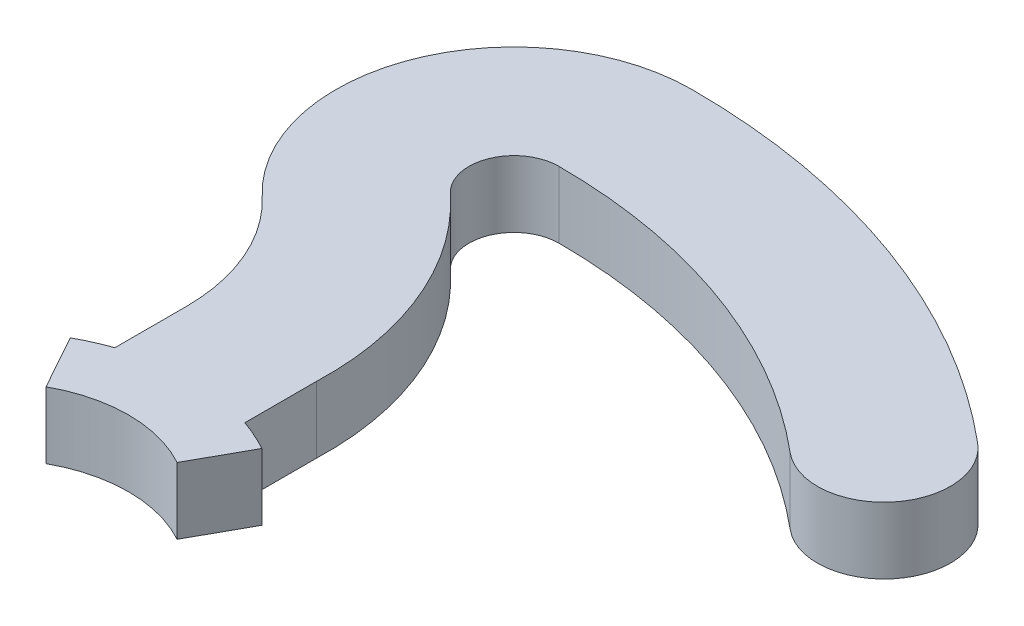
ISO-10303-21;
HEADER;
FILE_DESCRIPTION(('STEP AP214'),'2;1');
FILE_NAME('part.step','',(''),(''),'','','');
FILE_SCHEMA(('AUTOMOTIVE_DESIGN { 1 0 10303 214 1 1 1 1 }'));
ENDSEC;
DATA;
#1=APPLICATION_CONTEXT('core data for automotive mechanical design processes');
#2=APPLICATION_PROTOCOL_DEFINITION('international standard','automotive_design',2000,#1);
#3=PRODUCT_CONTEXT('',#1,'mechanical');
#4=PRODUCT('Part','Part','',(#3));
#5=PRODUCT_RELATED_PRODUCT_CATEGORY('part','',(#4));
#6=PRODUCT_DEFINITION_FORMATION('','',#4);
#7=PRODUCT_DEFINITION_CONTEXT('part definition',#1,'design');
#8=PRODUCT_DEFINITION('design','',#6,#7);
#9=PRODUCT_DEFINITION_SHAPE('','',#8);
#10=(LENGTH_UNIT() NAMED_UNIT(*) SI_UNIT(.MILLI.,.METRE.));
#11=(NAMED_UNIT(*) PLANE_ANGLE_UNIT() SI_UNIT($,.RADIAN.));
#12=(NAMED_UNIT(*) SI_UNIT($,.STERADIAN.) SOLID_ANGLE_UNIT());
#13=UNCERTAINTY_MEASURE_WITH_UNIT(LENGTH_MEASURE(1.E-05),#10,'distance_accuracy_value','');
#14=(GEOMETRIC_REPRESENTATION_CONTEXT(3) GLOBAL_UNCERTAINTY_ASSIGNED_CONTEXT((#13)) GLOBAL_UNIT_ASSIGNED_CONTEXT((#10,
#11,#12)) REPRESENTATION_CONTEXT('',''));
#15=CARTESIAN_POINT('',(0.,0.,0.));
#16=DIRECTION('',(0.,0.,1.));
#17=DIRECTION('',(1.,0.,0.));
#18=AXIS2_PLACEMENT_3D('',#15,#16,#17);
#19=CARTESIAN_POINT('',(6.2,3.175,0.));
#20=DIRECTION('',(-1.,0.,0.));
#21=DIRECTION('',(0.,0.,1.));
#22=AXIS2_PLACEMENT_3D('',#19,#20,#21);
#23=PLANE('',#22);
#24=DIRECTION('',(0.,0.,-1.));
#25=VECTOR('',#24,1.);
#26=CARTESIAN_POINT('',(6.2,-3.175,0.));
#27=LINE('',#26,#25);
#28=CARTESIAN_POINT('',(6.2,-3.175,-17.8011937801935));
#29=VERTEX_POINT('',#28);
#30=CARTESIAN_POINT('',(6.2,-3.175,-24.631686909345));
#31=VERTEX_POINT('',#30);
#32=EDGE_CURVE('E174',#29,#31,#27,.T.);
#33=ORIENTED_EDGE('',*,*,#32,.T.);
#34=DIRECTION('',(0.,-1.,0.));
#35=VECTOR('',#34,1.);
#36=CARTESIAN_POINT('',(6.2,3.175,-24.631686909345));
#37=LINE('',#36,#35);
#38=CARTESIAN_POINT('',(6.2,3.175,-24.631686909345));
#39=VERTEX_POINT('',#38);
#40=EDGE_CURVE('E11',#39,#31,#37,.T.);
#41=ORIENTED_EDGE('',*,*,#40,.F.);
#42=DIRECTION('',(0.,0.,-1.));
#43=VECTOR('',#42,1.);
#44=CARTESIAN_POINT('',(6.2,3.175,0.));
#45=LINE('',#44,#43);
#46=CARTESIAN_POINT('',(6.2,3.175,-17.8011937801935));
#47=VERTEX_POINT('',#46);
#48=EDGE_CURVE('E210',#47,#39,#45,.T.);
#49=ORIENTED_EDGE('',*,*,#48,.F.);
#50=DIRECTION('',(0.,-1.,0.));
#51=VECTOR('',#50,1.);
#52=CARTESIAN_POINT('',(6.2,3.175,-17.8011937801935));
#53=LINE('',#52,#51);
#54=EDGE_CURVE('E55',#47,#29,#53,.T.);
#55=ORIENTED_EDGE('',*,*,#54,.T.);
#56=EDGE_LOOP('',(#33,#41,#49,#55));
#57=FACE_BOUND('',#56,.T.);
#58=ADVANCED_FACE('F39',(#57),#23,.F.);
#59=CARTESIAN_POINT('',(-22.2918601541075,3.175,-25.6203194208465));
#60=DIRECTION('',(0.,-1.,0.));
#61=DIRECTION('',(0.,0.,-1.));
#62=AXIS2_PLACEMENT_3D('',#59,#60,#61);
#63=CYLINDRICAL_SURFACE('',#62,28.5090071606153);
#64=CARTESIAN_POINT('',(-22.2918601541075,-3.175,-25.6203194208465));
#65=DIRECTION('',(0.,1.,0.));
#66=DIRECTION('',(0.,0.,1.));
#67=AXIS2_PLACEMENT_3D('',#64,#65,#66);
#68=CIRCLE('',#67,28.5090071606153);
#69=CARTESIAN_POINT('',(-2.94847643107434,-3.175,-46.5630268730245));
#70=VERTEX_POINT('',#69);
#71=EDGE_CURVE('E176',#31,#70,#68,.T.);
#72=ORIENTED_EDGE('',*,*,#71,.T.);
#73=DIRECTION('',(0.,-1.,0.));
#74=VECTOR('',#73,1.);
#75=CARTESIAN_POINT('',(-2.94847643107434,3.175,-46.5630268730245));
#76=LINE('',#75,#74);
#77=CARTESIAN_POINT('',(-2.94847643107434,3.175,-46.5630268730245));
#78=VERTEX_POINT('',#77);
#79=EDGE_CURVE('E47',#78,#70,#76,.T.);
#80=ORIENTED_EDGE('',*,*,#79,.F.);
#81=CARTESIAN_POINT('',(-22.2918601541075,3.175,-25.6203194208465));
#82=DIRECTION('',(0.,1.,0.));
#83=DIRECTION('',(0.,0.,1.));
#84=AXIS2_PLACEMENT_3D('',#81,#82,#83);
#85=CIRCLE('',#84,28.5090071606153);
#86=EDGE_CURVE('E112',#39,#78,#85,.T.);
#87=ORIENTED_EDGE('',*,*,#86,.F.);
#88=ORIENTED_EDGE('',*,*,#40,.T.);
#89=EDGE_LOOP('',(#72,#80,#87,#88));
#90=FACE_BOUND('',#89,.T.);
#91=ADVANCED_FACE('F237',(#90),#63,.T.);
#92=CARTESIAN_POINT('',(0.,3.175,-49.6825627630093));
#93=DIRECTION('',(0.,-1.,0.));
#94=DIRECTION('',(0.,0.,-1.));
#95=AXIS2_PLACEMENT_3D('',#92,#93,#94);
#96=CYLINDRICAL_SURFACE('',#95,4.29243723699069);
#97=CARTESIAN_POINT('',(0.,-3.175,-49.6825627630093));
#98=DIRECTION('',(0.,1.,0.));
#99=DIRECTION('',(0.,0.,1.));
#100=AXIS2_PLACEMENT_3D('',#97,#98,#99);
#101=CIRCLE('',#100,4.29243723699069);
#102=CARTESIAN_POINT('',(0.,-3.175,-53.975));
#103=VERTEX_POINT('',#102);
#104=EDGE_CURVE('E179',#103,#70,#101,.T.);
#105=ORIENTED_EDGE('',*,*,#104,.F.);
#106=DIRECTION('',(0.,-1.,0.));
#107=VECTOR('',#106,1.);
#108=CARTESIAN_POINT('',(0.,3.175,-53.975));
#109=LINE('',#108,#107);
#110=CARTESIAN_POINT('',(0.,3.175,-53.975));
#111=VERTEX_POINT('',#110);
#112=EDGE_CURVE('E230',#111,#103,#109,.T.);
#113=ORIENTED_EDGE('',*,*,#112,.F.);
#114=CARTESIAN_POINT('',(0.,3.175,-49.6825627630093));
#115=DIRECTION('',(0.,1.,0.));
#116=DIRECTION('',(0.,0.,1.));
#117=AXIS2_PLACEMENT_3D('',#114,#115,#116);
#118=CIRCLE('',#117,4.29243723699069);
#119=EDGE_CURVE('E236',#111,#78,#118,.T.);
#120=ORIENTED_EDGE('',*,*,#119,.T.);
#121=ORIENTED_EDGE('',*,*,#79,.T.);
#122=EDGE_LOOP('',(#105,#113,#120,#121));
#123=FACE_BOUND('',#122,.T.);
#124=ADVANCED_FACE('F234',(#123),#96,.F.);
#125=CARTESIAN_POINT('',(0.,3.175,0.));
#126=DIRECTION('',(0.,-1.,0.));
#127=DIRECTION('',(0.,0.,-1.));
#128=AXIS2_PLACEMENT_3D('',#125,#126,#127);
#129=CYLINDRICAL_SURFACE('',#128,53.975);
#130=CARTESIAN_POINT('',(0.,-3.175,0.));
#131=DIRECTION('',(0.,1.,0.));
#132=DIRECTION('',(0.,0.,1.));
#133=AXIS2_PLACEMENT_3D('',#130,#131,#132);
#134=CIRCLE('',#133,53.975);
#135=CARTESIAN_POINT('',(34.6944612328307,-3.175,-41.347248817347));
#136=VERTEX_POINT('',#135);
#137=EDGE_CURVE('E182',#136,#103,#134,.T.);
#138=ORIENTED_EDGE('',*,*,#137,.F.);
#139=DIRECTION('',(0.,-1.,0.));
#140=VECTOR('',#139,1.);
#141=CARTESIAN_POINT('',(34.6944612328307,3.175,-41.347248817347));
#142=LINE('',#141,#140);
#143=CARTESIAN_POINT('',(34.6944612328307,3.175,-41.347248817347));
#144=VERTEX_POINT('',#143);
#145=EDGE_CURVE('E228',#144,#136,#142,.T.);
#146=ORIENTED_EDGE('',*,*,#145,.F.);
#147=CARTESIAN_POINT('',(0.,3.175,0.));
#148=DIRECTION('',(0.,1.,0.));
#149=DIRECTION('',(0.,0.,1.));
#150=AXIS2_PLACEMENT_3D('',#147,#148,#149);
#151=CIRCLE('',#150,53.975);
#152=EDGE_CURVE('E249',#144,#111,#151,.T.);
#153=ORIENTED_EDGE('',*,*,#152,.T.);
#154=ORIENTED_EDGE('',*,*,#112,.T.);
#155=EDGE_LOOP('',(#138,#146,#153,#154));
#156=FACE_BOUND('',#155,.T.);
#157=ADVANCED_FACE('F245',(#156),#129,.F.);
#158=CARTESIAN_POINT('',(38.7761625543402,3.175,-46.2116310311526));
#159=DIRECTION('',(0.,-1.,0.));
#160=DIRECTION('',(0.,0.,-1.));
#161=AXIS2_PLACEMENT_3D('',#158,#159,#160);
#162=CYLINDRICAL_SURFACE('',#161,6.34999999999999);
#163=CARTESIAN_POINT('',(38.7761625543402,-3.175,-46.2116310311526));
#164=DIRECTION('',(0.,1.,0.));
#165=DIRECTION('',(0.,0.,1.));
#166=AXIS2_PLACEMENT_3D('',#163,#164,#165);
#167=CIRCLE('',#166,6.34999999999999);
#168=CARTESIAN_POINT('',(42.8578638758497,-3.175,-51.0760132449581));
#169=VERTEX_POINT('',#168);
#170=EDGE_CURVE('E185',#136,#169,#167,.T.);
#171=ORIENTED_EDGE('',*,*,#170,.T.);
#172=DIRECTION('',(0.,-1.,0.));
#173=VECTOR('',#172,1.);
#174=CARTESIAN_POINT('',(42.8578638758497,3.175,-51.0760132449581));
#175=LINE('',#174,#173);
#176=CARTESIAN_POINT('',(42.8578638758497,3.175,-51.0760132449581));
#177=VERTEX_POINT('',#176);
#178=EDGE_CURVE('E225',#177,#169,#175,.T.);
#179=ORIENTED_EDGE('',*,*,#178,.F.);
#180=CARTESIAN_POINT('',(38.7761625543402,3.175,-46.2116310311526));
#181=DIRECTION('',(0.,1.,0.));
#182=DIRECTION('',(0.,0.,1.));
#183=AXIS2_PLACEMENT_3D('',#180,#181,#182);
#184=CIRCLE('',#183,6.34999999999999);
#185=EDGE_CURVE('E251',#144,#177,#184,.T.);
#186=ORIENTED_EDGE('',*,*,#185,.F.);
#187=ORIENTED_EDGE('',*,*,#145,.T.);
#188=EDGE_LOOP('',(#171,#179,#186,#187));
#189=FACE_BOUND('',#188,.T.);
#190=ADVANCED_FACE('F297',(#189),#162,.T.);
#191=CARTESIAN_POINT('',(0.,3.175,0.));
#192=DIRECTION('',(0.,-1.,0.));
#193=DIRECTION('',(0.,0.,-1.));
#194=AXIS2_PLACEMENT_3D('',#191,#192,#193);
#195=CYLINDRICAL_SURFACE('',#194,66.675);
#196=CARTESIAN_POINT('',(0.,-3.175,0.));
#197=DIRECTION('',(0.,1.,0.));
#198=DIRECTION('',(0.,0.,1.));
#199=AXIS2_PLACEMENT_3D('',#196,#197,#198);
#200=CIRCLE('',#199,66.675);
#201=CARTESIAN_POINT('',(0.,-3.175,-66.675));
#202=VERTEX_POINT('',#201);
#203=EDGE_CURVE('E187',#169,#202,#200,.T.);
#204=ORIENTED_EDGE('',*,*,#203,.T.);
#205=DIRECTION('',(0.,-1.,0.));
#206=VECTOR('',#205,1.);
#207=CARTESIAN_POINT('',(0.,3.175,-66.675));
#208=LINE('',#207,#206);
#209=CARTESIAN_POINT('',(0.,3.175,-66.675));
#210=VERTEX_POINT('',#209);
#211=EDGE_CURVE('E222',#210,#202,#208,.T.);
#212=ORIENTED_EDGE('',*,*,#211,.F.);
#213=CARTESIAN_POINT('',(0.,3.175,0.));
#214=DIRECTION('',(0.,1.,0.));
#215=DIRECTION('',(0.,0.,1.));
#216=AXIS2_PLACEMENT_3D('',#213,#214,#215);
#217=CIRCLE('',#216,66.675);
#218=EDGE_CURVE('E257',#177,#210,#217,.T.);
#219=ORIENTED_EDGE('',*,*,#218,.F.);
#220=ORIENTED_EDGE('',*,*,#178,.T.);
#221=EDGE_LOOP('',(#204,#212,#219,#220));
#222=FACE_BOUND('',#221,.T.);
#223=ADVANCED_FACE('F300',(#222),#195,.T.);
#224=CARTESIAN_POINT('',(0.,3.175,-49.6825627630093));
#225=DIRECTION('',(0.,-1.,0.));
#226=DIRECTION('',(0.,0.,-1.));
#227=AXIS2_PLACEMENT_3D('',#224,#225,#226);
#228=CYLINDRICAL_SURFACE('',#227,16.9924372369907);
#229=CARTESIAN_POINT('',(0.,-3.175,-49.6825627630093));
#230=DIRECTION('',(0.,1.,0.));
#231=DIRECTION('',(0.,0.,1.));
#232=AXIS2_PLACEMENT_3D('',#229,#230,#231);
#233=CIRCLE('',#232,16.9924372369907);
#234=CARTESIAN_POINT('',(-11.6721102566201,-3.175,-37.333280783462));
#235=VERTEX_POINT('',#234);
#236=EDGE_CURVE('E189',#202,#235,#233,.T.);
#237=ORIENTED_EDGE('',*,*,#236,.T.);
#238=DIRECTION('',(0.,-1.,0.));
#239=VECTOR('',#238,1.);
#240=CARTESIAN_POINT('',(-11.6721102566201,3.175,-37.333280783462));
#241=LINE('',#240,#239);
#242=CARTESIAN_POINT('',(-11.6721102566201,3.175,-37.333280783462));
#243=VERTEX_POINT('',#242);
#244=EDGE_CURVE('E220',#243,#235,#241,.T.);
#245=ORIENTED_EDGE('',*,*,#244,.F.);
#246=CARTESIAN_POINT('',(0.,3.175,-49.6825627630093));
#247=DIRECTION('',(0.,1.,0.));
#248=DIRECTION('',(0.,0.,1.));
#249=AXIS2_PLACEMENT_3D('',#246,#247,#248);
#250=CIRCLE('',#249,16.9924372369907);
#251=EDGE_CURVE('E259',#210,#243,#250,.T.);
#252=ORIENTED_EDGE('',*,*,#251,.F.);
#253=ORIENTED_EDGE('',*,*,#211,.T.);
#254=EDGE_LOOP('',(#237,#245,#252,#253));
#255=FACE_BOUND('',#254,.T.);
#256=ADVANCED_FACE('F304',(#255),#228,.T.);
#257=CARTESIAN_POINT('',(-23.6772134180055,3.175,-24.631686909345));
#258=DIRECTION('',(0.,-1.,0.));
#259=DIRECTION('',(0.,0.,-1.));
#260=AXIS2_PLACEMENT_3D('',#257,#258,#259);
#261=CYLINDRICAL_SURFACE('',#260,17.4772134180055);
#262=CARTESIAN_POINT('',(-23.6772134180055,-3.175,-24.631686909345));
#263=DIRECTION('',(0.,1.,0.));
#264=DIRECTION('',(0.,0.,1.));
#265=AXIS2_PLACEMENT_3D('',#262,#263,#264);
#266=CIRCLE('',#265,17.4772134180055);
#267=CARTESIAN_POINT('',(-6.2,-3.175,-24.631686909345));
#268=VERTEX_POINT('',#267);
#269=EDGE_CURVE('E192',#268,#235,#266,.T.);
#270=ORIENTED_EDGE('',*,*,#269,.F.);
#271=DIRECTION('',(0.,-1.,0.));
#272=VECTOR('',#271,1.);
#273=CARTESIAN_POINT('',(-6.2,3.175,-24.631686909345));
#274=LINE('',#273,#272);
#275=CARTESIAN_POINT('',(-6.2,3.175,-24.631686909345));
#276=VERTEX_POINT('',#275);
#277=EDGE_CURVE('E218',#276,#268,#274,.T.);
#278=ORIENTED_EDGE('',*,*,#277,.F.);
#279=CARTESIAN_POINT('',(-23.6772134180055,3.175,-24.631686909345));
#280=DIRECTION('',(0.,1.,0.));
#281=DIRECTION('',(0.,0.,1.));
#282=AXIS2_PLACEMENT_3D('',#279,#280,#281);
#283=CIRCLE('',#282,17.4772134180055);
#284=EDGE_CURVE('E261',#276,#243,#283,.T.);
#285=ORIENTED_EDGE('',*,*,#284,.T.);
#286=ORIENTED_EDGE('',*,*,#244,.T.);
#287=EDGE_LOOP('',(#270,#278,#285,#286));
#288=FACE_BOUND('',#287,.T.);
#289=ADVANCED_FACE('F308',(#288),#261,.F.);
#290=CARTESIAN_POINT('',(-6.20000000000001,3.175,0.));
#291=DIRECTION('',(-1.,0.,0.));
#292=DIRECTION('',(0.,0.,1.));
#293=AXIS2_PLACEMENT_3D('',#290,#291,#292);
#294=PLANE('',#293);
#295=DIRECTION('',(0.,0.,-1.));
#296=VECTOR('',#295,1.);
#297=CARTESIAN_POINT('',(-6.20000000000001,-3.175,0.));
#298=LINE('',#297,#296);
#299=CARTESIAN_POINT('',(-6.2,-3.175,-17.8011937801935));
#300=VERTEX_POINT('',#299);
#301=EDGE_CURVE('E195',#300,#268,#298,.T.);
#302=ORIENTED_EDGE('',*,*,#301,.F.);
#303=DIRECTION('',(0.,-1.,0.));
#304=VECTOR('',#303,1.);
#305=CARTESIAN_POINT('',(-6.2,3.175,-17.8011937801935));
#306=LINE('',#305,#304);
#307=CARTESIAN_POINT('',(-6.2,3.175,-17.8011937801935));
#308=VERTEX_POINT('',#307);
#309=EDGE_CURVE('E216',#308,#300,#306,.T.);
#310=ORIENTED_EDGE('',*,*,#309,.F.);
#311=DIRECTION('',(0.,0.,-1.));
#312=VECTOR('',#311,1.);
#313=CARTESIAN_POINT('',(-6.20000000000001,3.175,0.));
#314=LINE('',#313,#312);
#315=EDGE_CURVE('E264',#308,#276,#314,.T.);
#316=ORIENTED_EDGE('',*,*,#315,.T.);
#317=ORIENTED_EDGE('',*,*,#277,.T.);
#318=EDGE_LOOP('',(#302,#310,#316,#317));
#319=FACE_BOUND('',#318,.T.);
#320=ADVANCED_FACE('F312',(#319),#294,.T.);
#321=CARTESIAN_POINT('',(0.,3.175,0.));
#322=DIRECTION('',(0.,-1.,0.));
#323=DIRECTION('',(0.,0.,-1.));
#324=AXIS2_PLACEMENT_3D('',#321,#322,#323);
#325=CYLINDRICAL_SURFACE('',#324,18.85);
#326=CARTESIAN_POINT('',(0.,-3.175,0.));
#327=DIRECTION('',(0.,1.,0.));
#328=DIRECTION('',(0.,0.,1.));
#329=AXIS2_PLACEMENT_3D('',#326,#327,#328);
#330=CIRCLE('',#329,18.85);
#331=CARTESIAN_POINT('',(-9.1386613416436,-3.175,-16.4865814795775));
#332=VERTEX_POINT('',#331);
#333=EDGE_CURVE('E198',#332,#300,#330,.F.);
#334=ORIENTED_EDGE('',*,*,#333,.F.);
#335=DIRECTION('',(0.,-1.,0.));
#336=VECTOR('',#335,1.);
#337=CARTESIAN_POINT('',(-9.1386613416436,3.175,-16.4865814795775));
#338=LINE('',#337,#336);
#339=CARTESIAN_POINT('',(-9.1386613416436,3.175,-16.4865814795775));
#340=VERTEX_POINT('',#339);
#341=EDGE_CURVE('E214',#340,#332,#338,.T.);
#342=ORIENTED_EDGE('',*,*,#341,.F.);
#343=CARTESIAN_POINT('',(0.,3.175,0.));
#344=DIRECTION('',(0.,1.,0.));
#345=DIRECTION('',(0.,0.,1.));
#346=AXIS2_PLACEMENT_3D('',#343,#344,#345);
#347=CIRCLE('',#346,18.85);
#348=EDGE_CURVE('E169',#340,#308,#347,.F.);
#349=ORIENTED_EDGE('',*,*,#348,.T.);
#350=ORIENTED_EDGE('',*,*,#309,.T.);
#351=EDGE_LOOP('',(#334,#342,#349,#350));
#352=FACE_BOUND('',#351,.T.);
#353=ADVANCED_FACE('F269',(#352),#325,.T.);
#354=CARTESIAN_POINT('',(0.,3.175,0.));
#355=DIRECTION('',(-0.874619707139391,0.,0.484809620246345));
#356=DIRECTION('',(0.484809620246345,0.,0.874619707139391));
#357=AXIS2_PLACEMENT_3D('',#354,#355,#356);
#358=PLANE('',#357);
#359=DIRECTION('',(-0.484809620246345,0.,-0.874619707139391));
#360=VECTOR('',#359,1.);
#361=CARTESIAN_POINT('',(0.,-3.175,0.));
#362=LINE('',#361,#360);
#363=CARTESIAN_POINT('',(-6.25404410117785,-3.175,-11.2825942220982));
#364=VERTEX_POINT('',#363);
#365=EDGE_CURVE('E201',#364,#332,#362,.T.);
#366=ORIENTED_EDGE('',*,*,#365,.F.);
#367=DIRECTION('',(0.,-1.,0.));
#368=VECTOR('',#367,1.);
#369=CARTESIAN_POINT('',(-6.25404410117785,3.175,-11.2825942220982));
#370=LINE('',#369,#368);
#371=CARTESIAN_POINT('',(-6.25404410117785,3.175,-11.2825942220982));
#372=VERTEX_POINT('',#371);
#373=EDGE_CURVE('E155',#372,#364,#370,.T.);
#374=ORIENTED_EDGE('',*,*,#373,.F.);
#375=DIRECTION('',(-0.484809620246345,0.,-0.874619707139391));
#376=VECTOR('',#375,1.);
#377=CARTESIAN_POINT('',(0.,3.175,0.));
#378=LINE('',#377,#376);
#379=EDGE_CURVE('E167',#372,#340,#378,.T.);
#380=ORIENTED_EDGE('',*,*,#379,.T.);
#381=ORIENTED_EDGE('',*,*,#341,.T.);
#382=EDGE_LOOP('',(#366,#374,#380,#381));
#383=FACE_BOUND('',#382,.T.);
#384=ADVANCED_FACE('F275',(#383),#358,.T.);
#385=CARTESIAN_POINT('',(0.,3.175,0.));
#386=DIRECTION('',(0.,-1.,0.));
#387=DIRECTION('',(0.,0.,-1.));
#388=AXIS2_PLACEMENT_3D('',#385,#386,#387);
#389=CYLINDRICAL_SURFACE('',#388,12.9);
#390=CARTESIAN_POINT('',(0.,-3.175,0.));
#391=DIRECTION('',(0.,1.,0.));
#392=DIRECTION('',(0.,0.,1.));
#393=AXIS2_PLACEMENT_3D('',#390,#391,#392);
#394=CIRCLE('',#393,12.9);
#395=CARTESIAN_POINT('',(6.25404410117768,-3.175,-11.2825942220982));
#396=VERTEX_POINT('',#395);
#397=EDGE_CURVE('E152',#396,#364,#394,.T.);
#398=ORIENTED_EDGE('',*,*,#397,.F.);
#399=DIRECTION('',(0.,-1.,0.));
#400=VECTOR('',#399,1.);
#401=CARTESIAN_POINT('',(6.25404410117768,3.175,-11.2825942220982));
#402=LINE('',#401,#400);
#403=CARTESIAN_POINT('',(6.25404410117768,3.175,-11.2825942220982));
#404=VERTEX_POINT('',#403);
#405=EDGE_CURVE('E146',#404,#396,#402,.T.);
#406=ORIENTED_EDGE('',*,*,#405,.F.);
#407=CARTESIAN_POINT('',(0.,3.175,0.));
#408=DIRECTION('',(0.,1.,0.));
#409=DIRECTION('',(0.,0.,1.));
#410=AXIS2_PLACEMENT_3D('',#407,#408,#409);
#411=CIRCLE('',#410,12.9);
#412=EDGE_CURVE('E150',#404,#372,#411,.T.);
#413=ORIENTED_EDGE('',*,*,#412,.T.);
#414=ORIENTED_EDGE('',*,*,#373,.T.);
#415=EDGE_LOOP('',(#398,#406,#413,#414));
#416=FACE_BOUND('',#415,.T.);
#417=ADVANCED_FACE('F148',(#416),#389,.F.);
#418=CARTESIAN_POINT('',(0.,3.175,0.));
#419=DIRECTION('',(-0.874619707139398,0.,-0.484809620246332));
#420=DIRECTION('',(-0.484809620246332,0.,0.874619707139399));
#421=AXIS2_PLACEMENT_3D('',#418,#419,#420);
#422=PLANE('',#421);
#423=DIRECTION('',(0.484809620246332,0.,-0.874619707139399));
#424=VECTOR('',#423,1.);
#425=CARTESIAN_POINT('',(0.,-3.175,0.));
#426=LINE('',#425,#424);
#427=CARTESIAN_POINT('',(9.13866134164336,-3.175,-16.4865814795777));
#428=VERTEX_POINT('',#427);
#429=EDGE_CURVE('E205',#396,#428,#426,.T.);
#430=ORIENTED_EDGE('',*,*,#429,.T.);
#431=DIRECTION('',(0.,-1.,0.));
#432=VECTOR('',#431,1.);
#433=CARTESIAN_POINT('',(9.13866134164336,3.175,-16.4865814795777));
#434=LINE('',#433,#432);
#435=CARTESIAN_POINT('',(9.13866134164336,3.175,-16.4865814795777));
#436=VERTEX_POINT('',#435);
#437=EDGE_CURVE('E100',#436,#428,#434,.T.);
#438=ORIENTED_EDGE('',*,*,#437,.F.);
#439=DIRECTION('',(0.484809620246332,0.,-0.874619707139399));
#440=VECTOR('',#439,1.);
#441=CARTESIAN_POINT('',(0.,3.175,0.));
#442=LINE('',#441,#440);
#443=EDGE_CURVE('E157',#404,#436,#442,.T.);
#444=ORIENTED_EDGE('',*,*,#443,.F.);
#445=ORIENTED_EDGE('',*,*,#405,.T.);
#446=EDGE_LOOP('',(#430,#438,#444,#445));
#447=FACE_BOUND('',#446,.T.);
#448=ADVANCED_FACE('F158',(#447),#422,.F.);
#449=CARTESIAN_POINT('',(0.,3.175,0.));
#450=DIRECTION('',(0.,-1.,0.));
#451=DIRECTION('',(0.,0.,-1.));
#452=AXIS2_PLACEMENT_3D('',#449,#450,#451);
#453=CYLINDRICAL_SURFACE('',#452,18.85);
#454=CARTESIAN_POINT('',(0.,-3.175,0.));
#455=DIRECTION('',(0.,1.,0.));
#456=DIRECTION('',(0.,0.,1.));
#457=AXIS2_PLACEMENT_3D('',#454,#455,#456);
#458=CIRCLE('',#457,18.85);
#459=EDGE_CURVE('E207',#29,#428,#458,.F.);
#460=ORIENTED_EDGE('',*,*,#459,.F.);
#461=ORIENTED_EDGE('',*,*,#54,.F.);
#462=CARTESIAN_POINT('',(0.,3.175,0.));
#463=DIRECTION('',(0.,1.,0.));
#464=DIRECTION('',(0.,0.,1.));
#465=AXIS2_PLACEMENT_3D('',#462,#463,#464);
#466=CIRCLE('',#465,18.85);
#467=EDGE_CURVE('E161',#47,#436,#466,.F.);
#468=ORIENTED_EDGE('',*,*,#467,.T.);
#469=ORIENTED_EDGE('',*,*,#437,.T.);
#470=EDGE_LOOP('',(#460,#461,#468,#469));
#471=FACE_BOUND('',#470,.T.);
#472=ADVANCED_FACE('F276',(#471),#453,.T.);
#473=CARTESIAN_POINT('',(0.,3.175,0.));
#474=DIRECTION('',(0.,1.,0.));
#475=DIRECTION('',(0.,0.,1.));
#476=AXIS2_PLACEMENT_3D('',#473,#474,#475);
#477=PLANE('',#476);
#478=ORIENTED_EDGE('',*,*,#48,.T.);
#479=ORIENTED_EDGE('',*,*,#86,.T.);
#480=ORIENTED_EDGE('',*,*,#119,.F.);
#481=ORIENTED_EDGE('',*,*,#152,.F.);
#482=ORIENTED_EDGE('',*,*,#185,.T.);
#483=ORIENTED_EDGE('',*,*,#218,.T.);
#484=ORIENTED_EDGE('',*,*,#251,.T.);
#485=ORIENTED_EDGE('',*,*,#284,.F.);
#486=ORIENTED_EDGE('',*,*,#315,.F.);
#487=ORIENTED_EDGE('',*,*,#348,.F.);
#488=ORIENTED_EDGE('',*,*,#379,.F.);
#489=ORIENTED_EDGE('',*,*,#412,.F.);
#490=ORIENTED_EDGE('',*,*,#443,.T.);
#491=ORIENTED_EDGE('',*,*,#467,.F.);
#492=EDGE_LOOP('',(#478,#479,#480,#481,#482,#483,#484,#485,#486,#487,#488,#489,#490,#491));
#493=FACE_BOUND('',#492,.T.);
#494=ADVANCED_FACE('F164',(#493),#477,.T.);
#495=CARTESIAN_POINT('',(0.,-3.175,0.));
#496=DIRECTION('',(0.,1.,0.));
#497=DIRECTION('',(0.,0.,1.));
#498=AXIS2_PLACEMENT_3D('',#495,#496,#497);
#499=PLANE('',#498);
#500=ORIENTED_EDGE('',*,*,#32,.F.);
#501=ORIENTED_EDGE('',*,*,#459,.T.);
#502=ORIENTED_EDGE('',*,*,#429,.F.);
#503=ORIENTED_EDGE('',*,*,#397,.T.);
#504=ORIENTED_EDGE('',*,*,#365,.T.);
#505=ORIENTED_EDGE('',*,*,#333,.T.);
#506=ORIENTED_EDGE('',*,*,#301,.T.);
#507=ORIENTED_EDGE('',*,*,#269,.T.);
#508=ORIENTED_EDGE('',*,*,#236,.F.);
#509=ORIENTED_EDGE('',*,*,#203,.F.);
#510=ORIENTED_EDGE('',*,*,#170,.F.);
#511=ORIENTED_EDGE('',*,*,#137,.T.);
#512=ORIENTED_EDGE('',*,*,#104,.T.);
#513=ORIENTED_EDGE('',*,*,#71,.F.);
#514=EDGE_LOOP('',(#500,#501,#502,#503,#504,#505,#506,#507,#508,#509,#510,#511,#512,#513));
#515=FACE_BOUND('',#514,.T.);
#516=ADVANCED_FACE('F240',(#515),#499,.F.);
#517=CLOSED_SHELL('',(#58,#91,#124,#157,#190,#223,#256,#289,#320,#353,#384,#417,#448,#472,#494,#516));
#518=MANIFOLD_SOLID_BREP('B2',#517);
#519=ADVANCED_BREP_SHAPE_REPRESENTATION('',(#18,#518),#14);
#520=SHAPE_DEFINITION_REPRESENTATION(#9,#519);
ENDSEC;
END-ISO-10303-21;
